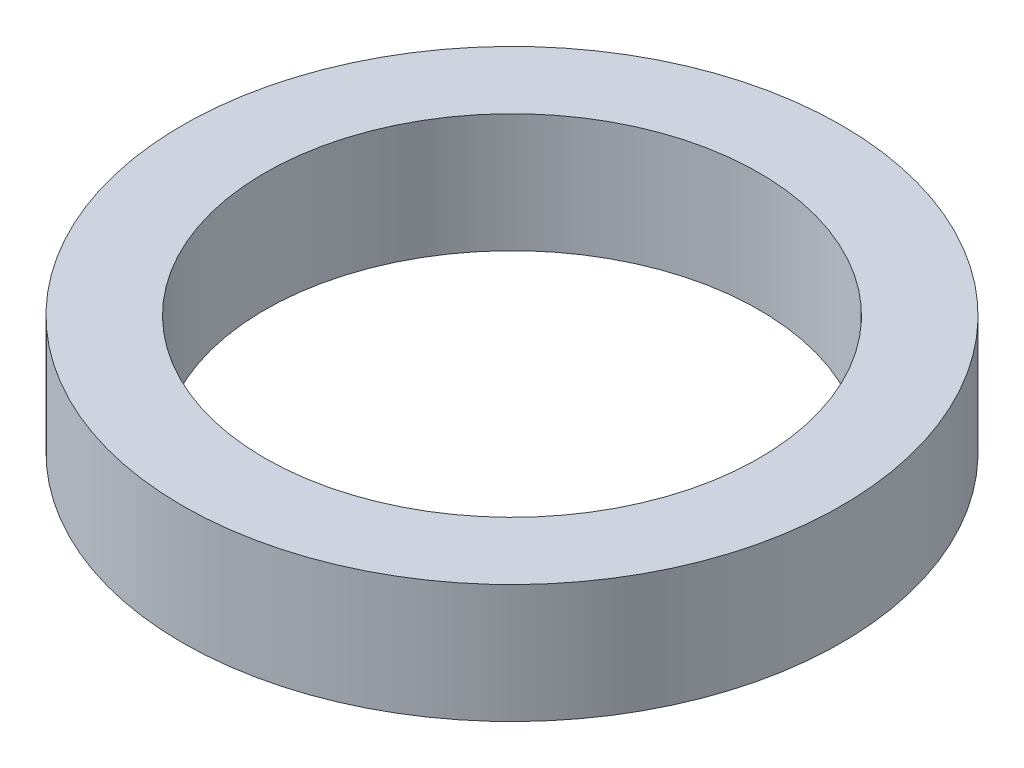
ISO-10303-21;
HEADER;
FILE_DESCRIPTION(('STEP AP214'),'2;1');
FILE_NAME('part.step','',(''),(''),'','','');
FILE_SCHEMA(('AUTOMOTIVE_DESIGN { 1 0 10303 214 1 1 1 1 }'));
ENDSEC;
DATA;
#1=APPLICATION_CONTEXT('core data for automotive mechanical design processes');
#2=APPLICATION_PROTOCOL_DEFINITION('international standard','automotive_design',2000,#1);
#3=PRODUCT_CONTEXT('',#1,'mechanical');
#4=PRODUCT('Part','Part','',(#3));
#5=PRODUCT_RELATED_PRODUCT_CATEGORY('part','',(#4));
#6=PRODUCT_DEFINITION_FORMATION('','',#4);
#7=PRODUCT_DEFINITION_CONTEXT('part definition',#1,'design');
#8=PRODUCT_DEFINITION('design','',#6,#7);
#9=PRODUCT_DEFINITION_SHAPE('','',#8);
#10=(LENGTH_UNIT() NAMED_UNIT(*) SI_UNIT(.MILLI.,.METRE.));
#11=(NAMED_UNIT(*) PLANE_ANGLE_UNIT() SI_UNIT($,.RADIAN.));
#12=(NAMED_UNIT(*) SI_UNIT($,.STERADIAN.) SOLID_ANGLE_UNIT());
#13=UNCERTAINTY_MEASURE_WITH_UNIT(LENGTH_MEASURE(1.E-05),#10,'distance_accuracy_value','');
#14=(GEOMETRIC_REPRESENTATION_CONTEXT(3) GLOBAL_UNCERTAINTY_ASSIGNED_CONTEXT((#13)) GLOBAL_UNIT_ASSIGNED_CONTEXT((#10,
#11,#12)) REPRESENTATION_CONTEXT('',''));
#15=CARTESIAN_POINT('',(0.,0.,0.));
#16=DIRECTION('',(0.,0.,1.));
#17=DIRECTION('',(1.,0.,0.));
#18=AXIS2_PLACEMENT_3D('',#15,#16,#17);
#19=CARTESIAN_POINT('',(0.,18.,0.));
#20=DIRECTION('',(0.,-1.,0.));
#21=DIRECTION('',(0.,0.,-1.));
#22=AXIS2_PLACEMENT_3D('',#19,#20,#21);
#23=CYLINDRICAL_SURFACE('',#22,50.);
#24=CARTESIAN_POINT('',(0.,18.,0.));
#25=DIRECTION('',(0.,1.,0.));
#26=DIRECTION('',(0.,0.,1.));
#27=AXIS2_PLACEMENT_3D('',#24,#25,#26);
#28=CIRCLE('',#27,50.);
#29=CARTESIAN_POINT('',(0.,18.,50.));
#30=VERTEX_POINT('',#29);
#31=EDGE_CURVE('E10',#30,#30,#28,.T.);
#32=ORIENTED_EDGE('',*,*,#31,.F.);
#33=EDGE_LOOP('',(#32));
#34=FACE_BOUND('',#33,.T.);
#35=CARTESIAN_POINT('',(0.,0.,0.));
#36=DIRECTION('',(0.,1.,0.));
#37=DIRECTION('',(0.,0.,1.));
#38=AXIS2_PLACEMENT_3D('',#35,#36,#37);
#39=CIRCLE('',#38,50.);
#40=CARTESIAN_POINT('',(0.,0.,50.));
#41=VERTEX_POINT('',#40);
#42=EDGE_CURVE('E37',#41,#41,#39,.T.);
#43=ORIENTED_EDGE('',*,*,#42,.T.);
#44=EDGE_LOOP('',(#43));
#45=FACE_BOUND('',#44,.T.);
#46=ADVANCED_FACE('F40',(#34,#45),#23,.T.);
#47=CARTESIAN_POINT('',(0.,18.,0.));
#48=DIRECTION('',(0.,1.,0.));
#49=DIRECTION('',(0.,0.,1.));
#50=AXIS2_PLACEMENT_3D('',#47,#48,#49);
#51=PLANE('',#50);
#52=CARTESIAN_POINT('',(0.,18.,0.));
#53=DIRECTION('',(0.,1.,0.));
#54=DIRECTION('',(0.,0.,1.));
#55=AXIS2_PLACEMENT_3D('',#52,#53,#54);
#56=CIRCLE('',#55,37.5);
#57=CARTESIAN_POINT('',(0.,18.,37.5));
#58=VERTEX_POINT('',#57);
#59=EDGE_CURVE('E50',#58,#58,#56,.T.);
#60=ORIENTED_EDGE('',*,*,#59,.F.);
#61=EDGE_LOOP('',(#60));
#62=FACE_BOUND('',#61,.T.);
#63=ORIENTED_EDGE('',*,*,#31,.T.);
#64=EDGE_LOOP('',(#63));
#65=FACE_BOUND('',#64,.T.);
#66=ADVANCED_FACE('F59',(#62,#65),#51,.T.);
#67=CARTESIAN_POINT('',(0.,0.,0.));
#68=DIRECTION('',(0.,1.,0.));
#69=DIRECTION('',(0.,0.,1.));
#70=AXIS2_PLACEMENT_3D('',#67,#68,#69);
#71=PLANE('',#70);
#72=CARTESIAN_POINT('',(0.,0.,0.));
#73=DIRECTION('',(0.,1.,0.));
#74=DIRECTION('',(0.,0.,1.));
#75=AXIS2_PLACEMENT_3D('',#72,#73,#74);
#76=CIRCLE('',#75,37.5);
#77=CARTESIAN_POINT('',(0.,0.,37.5));
#78=VERTEX_POINT('',#77);
#79=EDGE_CURVE('E47',#78,#78,#76,.T.);
#80=ORIENTED_EDGE('',*,*,#79,.T.);
#81=EDGE_LOOP('',(#80));
#82=FACE_BOUND('',#81,.T.);
#83=ORIENTED_EDGE('',*,*,#42,.F.);
#84=EDGE_LOOP('',(#83));
#85=FACE_BOUND('',#84,.T.);
#86=ADVANCED_FACE('F58',(#82,#85),#71,.F.);
#87=CARTESIAN_POINT('',(0.,18.,0.));
#88=DIRECTION('',(0.,-1.,0.));
#89=DIRECTION('',(0.,0.,-1.));
#90=AXIS2_PLACEMENT_3D('',#87,#88,#89);
#91=CYLINDRICAL_SURFACE('',#90,37.5);
#92=ORIENTED_EDGE('',*,*,#59,.T.);
#93=EDGE_LOOP('',(#92));
#94=FACE_BOUND('',#93,.T.);
#95=ORIENTED_EDGE('',*,*,#79,.F.);
#96=EDGE_LOOP('',(#95));
#97=FACE_BOUND('',#96,.T.);
#98=ADVANCED_FACE('F54',(#94,#97),#91,.F.);
#99=CLOSED_SHELL('',(#46,#66,#86,#98));
#100=MANIFOLD_SOLID_BREP('B2',#99);
#101=ADVANCED_BREP_SHAPE_REPRESENTATION('',(#18,#100),#14);
#102=SHAPE_DEFINITION_REPRESENTATION(#9,#101);
ENDSEC;
END-ISO-10303-21;
